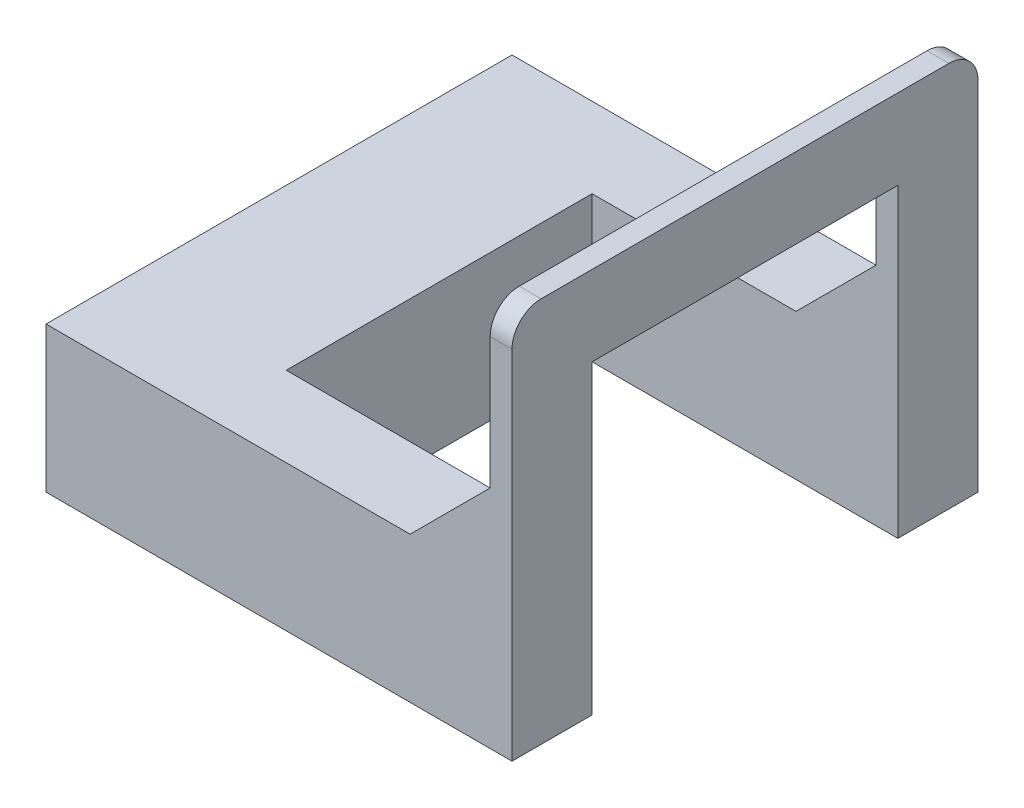
ISO-10303-21;
HEADER;
FILE_DESCRIPTION(('STEP AP214'),'2;1');
FILE_NAME('part.step','',(''),(''),'','','');
FILE_SCHEMA(('AUTOMOTIVE_DESIGN { 1 0 10303 214 1 1 1 1 }'));
ENDSEC;
DATA;
#1=APPLICATION_CONTEXT('core data for automotive mechanical design processes');
#2=APPLICATION_PROTOCOL_DEFINITION('international standard','automotive_design',2000,#1);
#3=PRODUCT_CONTEXT('',#1,'mechanical');
#4=PRODUCT('Part','Part','',(#3));
#5=PRODUCT_RELATED_PRODUCT_CATEGORY('part','',(#4));
#6=PRODUCT_DEFINITION_FORMATION('','',#4);
#7=PRODUCT_DEFINITION_CONTEXT('part definition',#1,'design');
#8=PRODUCT_DEFINITION('design','',#6,#7);
#9=PRODUCT_DEFINITION_SHAPE('','',#8);
#10=(LENGTH_UNIT() NAMED_UNIT(*) SI_UNIT(.MILLI.,.METRE.));
#11=(NAMED_UNIT(*) PLANE_ANGLE_UNIT() SI_UNIT($,.RADIAN.));
#12=(NAMED_UNIT(*) SI_UNIT($,.STERADIAN.) SOLID_ANGLE_UNIT());
#13=UNCERTAINTY_MEASURE_WITH_UNIT(LENGTH_MEASURE(1.E-05),#10,'distance_accuracy_value','');
#14=(GEOMETRIC_REPRESENTATION_CONTEXT(3) GLOBAL_UNCERTAINTY_ASSIGNED_CONTEXT((#13)) GLOBAL_UNIT_ASSIGNED_CONTEXT((#10,
#11,#12)) REPRESENTATION_CONTEXT('',''));
#15=CARTESIAN_POINT('',(0.,0.,0.));
#16=DIRECTION('',(0.,0.,1.));
#17=DIRECTION('',(1.,0.,0.));
#18=AXIS2_PLACEMENT_3D('',#15,#16,#17);
#19=CARTESIAN_POINT('',(0.,100.,0.));
#20=DIRECTION('',(0.,-1.,0.));
#21=DIRECTION('',(0.,0.,-1.));
#22=AXIS2_PLACEMENT_3D('',#19,#20,#21);
#23=PLANE('',#22);
#24=DIRECTION('',(1.,0.,0.));
#25=VECTOR('',#24,1.);
#26=CARTESIAN_POINT('',(320.,100.,-265.));
#27=LINE('',#26,#25);
#28=CARTESIAN_POINT('',(110.,100.,-265.));
#29=VERTEX_POINT('',#28);
#30=CARTESIAN_POINT('',(250.,100.,-265.));
#31=VERTEX_POINT('',#30);
#32=EDGE_CURVE('E208',#29,#31,#27,.T.);
#33=ORIENTED_EDGE('',*,*,#32,.T.);
#34=DIRECTION('',(0.,0.,-1.));
#35=VECTOR('',#34,1.);
#36=CARTESIAN_POINT('',(250.,100.,-265.));
#37=LINE('',#36,#35);
#38=CARTESIAN_POINT('',(250.,100.,-320.));
#39=VERTEX_POINT('',#38);
#40=EDGE_CURVE('E156',#31,#39,#37,.T.);
#41=ORIENTED_EDGE('',*,*,#40,.T.);
#42=DIRECTION('',(-1.,0.,0.));
#43=VECTOR('',#42,1.);
#44=CARTESIAN_POINT('',(0.,100.,-320.));
#45=LINE('',#44,#43);
#46=CARTESIAN_POINT('',(0.,100.,-320.));
#47=VERTEX_POINT('',#46);
#48=EDGE_CURVE('E210',#39,#47,#45,.T.);
#49=ORIENTED_EDGE('',*,*,#48,.T.);
#50=DIRECTION('',(0.,0.,1.));
#51=VECTOR('',#50,1.);
#52=CARTESIAN_POINT('',(0.,100.,0.));
#53=LINE('',#52,#51);
#54=CARTESIAN_POINT('',(0.,100.,0.));
#55=VERTEX_POINT('',#54);
#56=EDGE_CURVE('E197',#47,#55,#53,.T.);
#57=ORIENTED_EDGE('',*,*,#56,.T.);
#58=DIRECTION('',(1.,0.,0.));
#59=VECTOR('',#58,1.);
#60=CARTESIAN_POINT('',(0.,100.,0.));
#61=LINE('',#60,#59);
#62=CARTESIAN_POINT('',(250.,100.,0.));
#63=VERTEX_POINT('',#62);
#64=EDGE_CURVE('E200',#55,#63,#61,.T.);
#65=ORIENTED_EDGE('',*,*,#64,.T.);
#66=DIRECTION('',(0.,0.,1.));
#67=VECTOR('',#66,1.);
#68=CARTESIAN_POINT('',(250.,100.,-55.));
#69=LINE('',#68,#67);
#70=CARTESIAN_POINT('',(250.,100.,-55.));
#71=VERTEX_POINT('',#70);
#72=EDGE_CURVE('E310',#71,#63,#69,.T.);
#73=ORIENTED_EDGE('',*,*,#72,.F.);
#74=DIRECTION('',(-1.,0.,0.));
#75=VECTOR('',#74,1.);
#76=CARTESIAN_POINT('',(110.,100.,-55.));
#77=LINE('',#76,#75);
#78=CARTESIAN_POINT('',(110.,100.,-55.));
#79=VERTEX_POINT('',#78);
#80=EDGE_CURVE('E204',#71,#79,#77,.T.);
#81=ORIENTED_EDGE('',*,*,#80,.T.);
#82=DIRECTION('',(0.,0.,-1.));
#83=VECTOR('',#82,1.);
#84=CARTESIAN_POINT('',(110.,100.,-265.));
#85=LINE('',#84,#83);
#86=EDGE_CURVE('E206',#79,#29,#85,.T.);
#87=ORIENTED_EDGE('',*,*,#86,.T.);
#88=EDGE_LOOP('',(#33,#41,#49,#57,#65,#73,#81,#87));
#89=FACE_BOUND('',#88,.T.);
#90=ADVANCED_FACE('F35',(#89),#23,.F.);
#91=CARTESIAN_POINT('',(0.,100.,0.));
#92=DIRECTION('',(1.,0.,0.));
#93=DIRECTION('',(0.,0.,-1.));
#94=AXIS2_PLACEMENT_3D('',#91,#92,#93);
#95=PLANE('',#94);
#96=DIRECTION('',(0.,0.,1.));
#97=VECTOR('',#96,1.);
#98=CARTESIAN_POINT('',(0.,0.,0.));
#99=LINE('',#98,#97);
#100=CARTESIAN_POINT('',(0.,0.,-320.));
#101=VERTEX_POINT('',#100);
#102=CARTESIAN_POINT('',(0.,0.,0.));
#103=VERTEX_POINT('',#102);
#104=EDGE_CURVE('E194',#101,#103,#99,.T.);
#105=ORIENTED_EDGE('',*,*,#104,.T.);
#106=DIRECTION('',(0.,-1.,0.));
#107=VECTOR('',#106,1.);
#108=CARTESIAN_POINT('',(0.,100.,0.));
#109=LINE('',#108,#107);
#110=EDGE_CURVE('E248',#55,#103,#109,.T.);
#111=ORIENTED_EDGE('',*,*,#110,.F.);
#112=ORIENTED_EDGE('',*,*,#56,.F.);
#113=DIRECTION('',(0.,-1.,0.));
#114=VECTOR('',#113,1.);
#115=CARTESIAN_POINT('',(0.,100.,-320.));
#116=LINE('',#115,#114);
#117=EDGE_CURVE('E212',#47,#101,#116,.T.);
#118=ORIENTED_EDGE('',*,*,#117,.T.);
#119=EDGE_LOOP('',(#105,#111,#112,#118));
#120=FACE_BOUND('',#119,.T.);
#121=ADVANCED_FACE('F300',(#120),#95,.F.);
#122=CARTESIAN_POINT('',(0.,100.,0.));
#123=DIRECTION('',(0.,0.,-1.));
#124=DIRECTION('',(-1.,0.,0.));
#125=AXIS2_PLACEMENT_3D('',#122,#123,#124);
#126=PLANE('',#125);
#127=DIRECTION('',(0.,-1.,0.));
#128=VECTOR('',#127,1.);
#129=CARTESIAN_POINT('',(320.,100.,0.));
#130=LINE('',#129,#128);
#131=CARTESIAN_POINT('',(320.,245.,0.));
#132=VERTEX_POINT('',#131);
#133=CARTESIAN_POINT('',(320.,0.,0.));
#134=VERTEX_POINT('',#133);
#135=EDGE_CURVE('E246',#132,#134,#130,.T.);
#136=ORIENTED_EDGE('',*,*,#135,.F.);
#137=DIRECTION('',(1.,0.,0.));
#138=VECTOR('',#137,1.);
#139=CARTESIAN_POINT('',(305.,245.,0.));
#140=LINE('',#139,#138);
#141=CARTESIAN_POINT('',(305.,245.,0.));
#142=VERTEX_POINT('',#141);
#143=EDGE_CURVE('E58',#132,#142,#140,.F.);
#144=ORIENTED_EDGE('',*,*,#143,.T.);
#145=DIRECTION('',(0.,-1.,0.));
#146=VECTOR('',#145,1.);
#147=CARTESIAN_POINT('',(305.,0.,0.));
#148=LINE('',#147,#146);
#149=CARTESIAN_POINT('',(305.,155.,0.));
#150=VERTEX_POINT('',#149);
#151=EDGE_CURVE('E183',#142,#150,#148,.T.);
#152=ORIENTED_EDGE('',*,*,#151,.T.);
#153=DIRECTION('',(-0.707106781186548,-0.707106781186548,0.));
#154=VECTOR('',#153,1.);
#155=CARTESIAN_POINT('',(305.,155.,0.));
#156=LINE('',#155,#154);
#157=EDGE_CURVE('E306',#150,#63,#156,.T.);
#158=ORIENTED_EDGE('',*,*,#157,.T.);
#159=ORIENTED_EDGE('',*,*,#64,.F.);
#160=ORIENTED_EDGE('',*,*,#110,.T.);
#161=DIRECTION('',(1.,0.,0.));
#162=VECTOR('',#161,1.);
#163=CARTESIAN_POINT('',(0.,0.,0.));
#164=LINE('',#163,#162);
#165=EDGE_CURVE('E215',#103,#134,#164,.T.);
#166=ORIENTED_EDGE('',*,*,#165,.T.);
#167=EDGE_LOOP('',(#136,#144,#152,#158,#159,#160,#166));
#168=FACE_BOUND('',#167,.T.);
#169=ADVANCED_FACE('F272',(#168),#126,.F.);
#170=CARTESIAN_POINT('',(110.,100.,-55.));
#171=DIRECTION('',(0.,0.,1.));
#172=DIRECTION('',(1.,0.,0.));
#173=AXIS2_PLACEMENT_3D('',#170,#171,#172);
#174=PLANE('',#173);
#175=ORIENTED_EDGE('',*,*,#80,.F.);
#176=DIRECTION('',(-0.707106781186548,-0.707106781186548,0.));
#177=VECTOR('',#176,1.);
#178=CARTESIAN_POINT('',(305.,155.,-55.));
#179=LINE('',#178,#177);
#180=CARTESIAN_POINT('',(305.,155.,-55.));
#181=VERTEX_POINT('',#180);
#182=EDGE_CURVE('E308',#181,#71,#179,.T.);
#183=ORIENTED_EDGE('',*,*,#182,.F.);
#184=DIRECTION('',(0.,1.,0.));
#185=VECTOR('',#184,1.);
#186=CARTESIAN_POINT('',(305.,0.,-55.));
#187=LINE('',#186,#185);
#188=CARTESIAN_POINT('',(305.,210.,-55.));
#189=VERTEX_POINT('',#188);
#190=EDGE_CURVE('E177',#181,#189,#187,.T.);
#191=ORIENTED_EDGE('',*,*,#190,.T.);
#192=DIRECTION('',(1.,0.,0.));
#193=VECTOR('',#192,1.);
#194=CARTESIAN_POINT('',(305.,210.,-55.));
#195=LINE('',#194,#193);
#196=CARTESIAN_POINT('',(320.,210.,-55.));
#197=VERTEX_POINT('',#196);
#198=EDGE_CURVE('E185',#189,#197,#195,.T.);
#199=ORIENTED_EDGE('',*,*,#198,.T.);
#200=DIRECTION('',(0.,-1.,0.));
#201=VECTOR('',#200,1.);
#202=CARTESIAN_POINT('',(320.,100.,-55.));
#203=LINE('',#202,#201);
#204=CARTESIAN_POINT('',(320.,0.,-55.));
#205=VERTEX_POINT('',#204);
#206=EDGE_CURVE('E243',#197,#205,#203,.T.);
#207=ORIENTED_EDGE('',*,*,#206,.T.);
#208=DIRECTION('',(-1.,0.,0.));
#209=VECTOR('',#208,1.);
#210=CARTESIAN_POINT('',(110.,0.,-55.));
#211=LINE('',#210,#209);
#212=CARTESIAN_POINT('',(110.,0.,-55.));
#213=VERTEX_POINT('',#212);
#214=EDGE_CURVE('E220',#205,#213,#211,.T.);
#215=ORIENTED_EDGE('',*,*,#214,.T.);
#216=DIRECTION('',(0.,-1.,0.));
#217=VECTOR('',#216,1.);
#218=CARTESIAN_POINT('',(110.,100.,-55.));
#219=LINE('',#218,#217);
#220=EDGE_CURVE('E240',#79,#213,#219,.T.);
#221=ORIENTED_EDGE('',*,*,#220,.F.);
#222=EDGE_LOOP('',(#175,#183,#191,#199,#207,#215,#221));
#223=FACE_BOUND('',#222,.T.);
#224=ADVANCED_FACE('F282',(#223),#174,.F.);
#225=CARTESIAN_POINT('',(110.,100.,-265.));
#226=DIRECTION('',(-1.,0.,0.));
#227=DIRECTION('',(0.,0.,1.));
#228=AXIS2_PLACEMENT_3D('',#225,#226,#227);
#229=PLANE('',#228);
#230=DIRECTION('',(0.,0.,-1.));
#231=VECTOR('',#230,1.);
#232=CARTESIAN_POINT('',(110.,0.,-265.));
#233=LINE('',#232,#231);
#234=CARTESIAN_POINT('',(110.,0.,-265.));
#235=VERTEX_POINT('',#234);
#236=EDGE_CURVE('E222',#213,#235,#233,.T.);
#237=ORIENTED_EDGE('',*,*,#236,.T.);
#238=DIRECTION('',(0.,-1.,0.));
#239=VECTOR('',#238,1.);
#240=CARTESIAN_POINT('',(110.,100.,-265.));
#241=LINE('',#240,#239);
#242=EDGE_CURVE('E237',#29,#235,#241,.T.);
#243=ORIENTED_EDGE('',*,*,#242,.F.);
#244=ORIENTED_EDGE('',*,*,#86,.F.);
#245=ORIENTED_EDGE('',*,*,#220,.T.);
#246=EDGE_LOOP('',(#237,#243,#244,#245));
#247=FACE_BOUND('',#246,.T.);
#248=ADVANCED_FACE('F320',(#247),#229,.F.);
#249=CARTESIAN_POINT('',(320.,100.,-265.));
#250=DIRECTION('',(0.,0.,-1.));
#251=DIRECTION('',(-1.,0.,0.));
#252=AXIS2_PLACEMENT_3D('',#249,#250,#251);
#253=PLANE('',#252);
#254=DIRECTION('',(0.707106781186548,0.707106781186548,0.));
#255=VECTOR('',#254,1.);
#256=CARTESIAN_POINT('',(250.,100.,-265.));
#257=LINE('',#256,#255);
#258=CARTESIAN_POINT('',(305.,155.,-265.));
#259=VERTEX_POINT('',#258);
#260=EDGE_CURVE('E151',#31,#259,#257,.T.);
#261=ORIENTED_EDGE('',*,*,#260,.F.);
#262=ORIENTED_EDGE('',*,*,#32,.F.);
#263=ORIENTED_EDGE('',*,*,#242,.T.);
#264=DIRECTION('',(1.,0.,0.));
#265=VECTOR('',#264,1.);
#266=CARTESIAN_POINT('',(320.,0.,-265.));
#267=LINE('',#266,#265);
#268=CARTESIAN_POINT('',(320.,0.,-265.));
#269=VERTEX_POINT('',#268);
#270=EDGE_CURVE('E224',#235,#269,#267,.T.);
#271=ORIENTED_EDGE('',*,*,#270,.T.);
#272=DIRECTION('',(0.,-1.,0.));
#273=VECTOR('',#272,1.);
#274=CARTESIAN_POINT('',(320.,100.,-265.));
#275=LINE('',#274,#273);
#276=CARTESIAN_POINT('',(320.,210.,-265.));
#277=VERTEX_POINT('',#276);
#278=EDGE_CURVE('E234',#277,#269,#275,.T.);
#279=ORIENTED_EDGE('',*,*,#278,.F.);
#280=DIRECTION('',(1.,0.,0.));
#281=VECTOR('',#280,1.);
#282=CARTESIAN_POINT('',(305.,210.,-265.));
#283=LINE('',#282,#281);
#284=CARTESIAN_POINT('',(305.,210.,-265.));
#285=VERTEX_POINT('',#284);
#286=EDGE_CURVE('E172',#285,#277,#283,.T.);
#287=ORIENTED_EDGE('',*,*,#286,.F.);
#288=DIRECTION('',(0.,-1.,0.));
#289=VECTOR('',#288,1.);
#290=CARTESIAN_POINT('',(305.,210.,-265.));
#291=LINE('',#290,#289);
#292=EDGE_CURVE('E166',#285,#259,#291,.T.);
#293=ORIENTED_EDGE('',*,*,#292,.T.);
#294=EDGE_LOOP('',(#261,#262,#263,#271,#279,#287,#293));
#295=FACE_BOUND('',#294,.T.);
#296=ADVANCED_FACE('F170',(#295),#253,.F.);
#297=CARTESIAN_POINT('',(320.,100.,-320.));
#298=DIRECTION('',(-1.,0.,0.));
#299=DIRECTION('',(0.,0.,1.));
#300=AXIS2_PLACEMENT_3D('',#297,#298,#299);
#301=PLANE('',#300);
#302=DIRECTION('',(0.,0.,1.));
#303=VECTOR('',#302,1.);
#304=CARTESIAN_POINT('',(320.,265.,0.));
#305=LINE('',#304,#303);
#306=CARTESIAN_POINT('',(320.,265.,-300.));
#307=VERTEX_POINT('',#306);
#308=CARTESIAN_POINT('',(320.,265.,-20.));
#309=VERTEX_POINT('',#308);
#310=EDGE_CURVE('E189',#307,#309,#305,.T.);
#311=ORIENTED_EDGE('',*,*,#310,.T.);
#312=CARTESIAN_POINT('',(320.,245.,-20.));
#313=DIRECTION('',(-1.,0.,0.));
#314=DIRECTION('',(0.,0.,1.));
#315=AXIS2_PLACEMENT_3D('',#312,#313,#314);
#316=CIRCLE('',#315,20.);
#317=EDGE_CURVE('E258',#309,#132,#316,.F.);
#318=ORIENTED_EDGE('',*,*,#317,.T.);
#319=ORIENTED_EDGE('',*,*,#135,.T.);
#320=DIRECTION('',(0.,0.,-1.));
#321=VECTOR('',#320,1.);
#322=CARTESIAN_POINT('',(320.,0.,-55.));
#323=LINE('',#322,#321);
#324=EDGE_CURVE('E218',#134,#205,#323,.T.);
#325=ORIENTED_EDGE('',*,*,#324,.T.);
#326=ORIENTED_EDGE('',*,*,#206,.F.);
#327=DIRECTION('',(0.,0.,-1.));
#328=VECTOR('',#327,1.);
#329=CARTESIAN_POINT('',(320.,210.,-55.));
#330=LINE('',#329,#328);
#331=EDGE_CURVE('E186',#197,#277,#330,.T.);
#332=ORIENTED_EDGE('',*,*,#331,.T.);
#333=ORIENTED_EDGE('',*,*,#278,.T.);
#334=DIRECTION('',(0.,0.,-1.));
#335=VECTOR('',#334,1.);
#336=CARTESIAN_POINT('',(320.,0.,-320.));
#337=LINE('',#336,#335);
#338=CARTESIAN_POINT('',(320.,0.,-320.));
#339=VERTEX_POINT('',#338);
#340=EDGE_CURVE('E226',#269,#339,#337,.T.);
#341=ORIENTED_EDGE('',*,*,#340,.T.);
#342=DIRECTION('',(0.,-1.,0.));
#343=VECTOR('',#342,1.);
#344=CARTESIAN_POINT('',(320.,100.,-320.));
#345=LINE('',#344,#343);
#346=CARTESIAN_POINT('',(320.,245.,-320.));
#347=VERTEX_POINT('',#346);
#348=EDGE_CURVE('E232',#347,#339,#345,.T.);
#349=ORIENTED_EDGE('',*,*,#348,.F.);
#350=CARTESIAN_POINT('',(320.,245.,-300.));
#351=DIRECTION('',(-1.,0.,0.));
#352=DIRECTION('',(0.,0.,1.));
#353=AXIS2_PLACEMENT_3D('',#350,#351,#352);
#354=CIRCLE('',#353,20.);
#355=EDGE_CURVE('E256',#347,#307,#354,.F.);
#356=ORIENTED_EDGE('',*,*,#355,.T.);
#357=EDGE_LOOP('',(#311,#318,#319,#325,#326,#332,#333,#341,#349,#356));
#358=FACE_BOUND('',#357,.T.);
#359=ADVANCED_FACE('F271',(#358),#301,.F.);
#360=CARTESIAN_POINT('',(0.,100.,-320.));
#361=DIRECTION('',(0.,0.,1.));
#362=DIRECTION('',(1.,0.,0.));
#363=AXIS2_PLACEMENT_3D('',#360,#361,#362);
#364=PLANE('',#363);
#365=DIRECTION('',(0.,1.,0.));
#366=VECTOR('',#365,1.);
#367=CARTESIAN_POINT('',(305.,265.,-320.));
#368=LINE('',#367,#366);
#369=CARTESIAN_POINT('',(305.,155.,-320.));
#370=VERTEX_POINT('',#369);
#371=CARTESIAN_POINT('',(305.,245.,-320.));
#372=VERTEX_POINT('',#371);
#373=EDGE_CURVE('E168',#370,#372,#368,.T.);
#374=ORIENTED_EDGE('',*,*,#373,.T.);
#375=DIRECTION('',(1.,0.,0.));
#376=VECTOR('',#375,1.);
#377=CARTESIAN_POINT('',(320.,245.,-320.));
#378=LINE('',#377,#376);
#379=EDGE_CURVE('E11',#372,#347,#378,.T.);
#380=ORIENTED_EDGE('',*,*,#379,.T.);
#381=ORIENTED_EDGE('',*,*,#348,.T.);
#382=DIRECTION('',(-1.,0.,0.));
#383=VECTOR('',#382,1.);
#384=CARTESIAN_POINT('',(0.,0.,-320.));
#385=LINE('',#384,#383);
#386=EDGE_CURVE('E201',#339,#101,#385,.T.);
#387=ORIENTED_EDGE('',*,*,#386,.T.);
#388=ORIENTED_EDGE('',*,*,#117,.F.);
#389=ORIENTED_EDGE('',*,*,#48,.F.);
#390=DIRECTION('',(0.707106781186548,0.707106781186548,0.));
#391=VECTOR('',#390,1.);
#392=CARTESIAN_POINT('',(250.,100.,-320.));
#393=LINE('',#392,#391);
#394=EDGE_CURVE('E161',#39,#370,#393,.T.);
#395=ORIENTED_EDGE('',*,*,#394,.T.);
#396=EDGE_LOOP('',(#374,#380,#381,#387,#388,#389,#395));
#397=FACE_BOUND('',#396,.T.);
#398=ADVANCED_FACE('F296',(#397),#364,.F.);
#399=CARTESIAN_POINT('',(0.,0.,0.));
#400=DIRECTION('',(0.,-1.,0.));
#401=DIRECTION('',(0.,0.,-1.));
#402=AXIS2_PLACEMENT_3D('',#399,#400,#401);
#403=PLANE('',#402);
#404=ORIENTED_EDGE('',*,*,#324,.F.);
#405=ORIENTED_EDGE('',*,*,#165,.F.);
#406=ORIENTED_EDGE('',*,*,#104,.F.);
#407=ORIENTED_EDGE('',*,*,#386,.F.);
#408=ORIENTED_EDGE('',*,*,#340,.F.);
#409=ORIENTED_EDGE('',*,*,#270,.F.);
#410=ORIENTED_EDGE('',*,*,#236,.F.);
#411=ORIENTED_EDGE('',*,*,#214,.F.);
#412=EDGE_LOOP('',(#404,#405,#406,#407,#408,#409,#410,#411));
#413=FACE_BOUND('',#412,.T.);
#414=ADVANCED_FACE('F278',(#413),#403,.T.);
#415=CARTESIAN_POINT('',(305.,0.,0.));
#416=DIRECTION('',(1.,0.,0.));
#417=DIRECTION('',(0.,0.,-1.));
#418=AXIS2_PLACEMENT_3D('',#415,#416,#417);
#419=PLANE('',#418);
#420=ORIENTED_EDGE('',*,*,#151,.F.);
#421=CARTESIAN_POINT('',(305.,245.,-20.));
#422=DIRECTION('',(1.,0.,0.));
#423=DIRECTION('',(0.,0.,-1.));
#424=AXIS2_PLACEMENT_3D('',#421,#422,#423);
#425=CIRCLE('',#424,20.);
#426=CARTESIAN_POINT('',(305.,265.,-20.));
#427=VERTEX_POINT('',#426);
#428=EDGE_CURVE('E43',#142,#427,#425,.F.);
#429=ORIENTED_EDGE('',*,*,#428,.T.);
#430=DIRECTION('',(0.,0.,1.));
#431=VECTOR('',#430,1.);
#432=CARTESIAN_POINT('',(305.,265.,0.));
#433=LINE('',#432,#431);
#434=CARTESIAN_POINT('',(305.,265.,-300.));
#435=VERTEX_POINT('',#434);
#436=EDGE_CURVE('E175',#435,#427,#433,.T.);
#437=ORIENTED_EDGE('',*,*,#436,.F.);
#438=CARTESIAN_POINT('',(305.,245.,-300.));
#439=DIRECTION('',(1.,0.,0.));
#440=DIRECTION('',(0.,0.,-1.));
#441=AXIS2_PLACEMENT_3D('',#438,#439,#440);
#442=CIRCLE('',#441,20.);
#443=EDGE_CURVE('E50',#435,#372,#442,.F.);
#444=ORIENTED_EDGE('',*,*,#443,.T.);
#445=ORIENTED_EDGE('',*,*,#373,.F.);
#446=DIRECTION('',(0.,0.,-1.));
#447=VECTOR('',#446,1.);
#448=CARTESIAN_POINT('',(305.,155.,-265.));
#449=LINE('',#448,#447);
#450=EDGE_CURVE('E154',#259,#370,#449,.T.);
#451=ORIENTED_EDGE('',*,*,#450,.F.);
#452=ORIENTED_EDGE('',*,*,#292,.F.);
#453=DIRECTION('',(0.,0.,-1.));
#454=VECTOR('',#453,1.);
#455=CARTESIAN_POINT('',(305.,210.,-55.));
#456=LINE('',#455,#454);
#457=EDGE_CURVE('E173',#189,#285,#456,.T.);
#458=ORIENTED_EDGE('',*,*,#457,.F.);
#459=ORIENTED_EDGE('',*,*,#190,.F.);
#460=DIRECTION('',(0.,0.,1.));
#461=VECTOR('',#460,1.);
#462=CARTESIAN_POINT('',(305.,155.,-55.));
#463=LINE('',#462,#461);
#464=EDGE_CURVE('E190',#181,#150,#463,.T.);
#465=ORIENTED_EDGE('',*,*,#464,.T.);
#466=EDGE_LOOP('',(#420,#429,#437,#444,#445,#451,#452,#458,#459,#465));
#467=FACE_BOUND('',#466,.T.);
#468=ADVANCED_FACE('F164',(#467),#419,.F.);
#469=CARTESIAN_POINT('',(305.,265.,0.));
#470=DIRECTION('',(0.,1.,0.));
#471=DIRECTION('',(0.,0.,1.));
#472=AXIS2_PLACEMENT_3D('',#469,#470,#471);
#473=PLANE('',#472);
#474=ORIENTED_EDGE('',*,*,#436,.T.);
#475=DIRECTION('',(1.,0.,0.));
#476=VECTOR('',#475,1.);
#477=CARTESIAN_POINT('',(320.,265.,-20.));
#478=LINE('',#477,#476);
#479=EDGE_CURVE('E253',#427,#309,#478,.T.);
#480=ORIENTED_EDGE('',*,*,#479,.T.);
#481=ORIENTED_EDGE('',*,*,#310,.F.);
#482=DIRECTION('',(1.,0.,0.));
#483=VECTOR('',#482,1.);
#484=CARTESIAN_POINT('',(305.,265.,-300.));
#485=LINE('',#484,#483);
#486=EDGE_CURVE('E251',#307,#435,#485,.F.);
#487=ORIENTED_EDGE('',*,*,#486,.T.);
#488=EDGE_LOOP('',(#474,#480,#481,#487));
#489=FACE_BOUND('',#488,.T.);
#490=ADVANCED_FACE('F266',(#489),#473,.T.);
#491=CARTESIAN_POINT('',(305.,210.,-55.));
#492=DIRECTION('',(0.,-1.,0.));
#493=DIRECTION('',(0.,0.,-1.));
#494=AXIS2_PLACEMENT_3D('',#491,#492,#493);
#495=PLANE('',#494);
#496=ORIENTED_EDGE('',*,*,#331,.F.);
#497=ORIENTED_EDGE('',*,*,#198,.F.);
#498=ORIENTED_EDGE('',*,*,#457,.T.);
#499=ORIENTED_EDGE('',*,*,#286,.T.);
#500=EDGE_LOOP('',(#496,#497,#498,#499));
#501=FACE_BOUND('',#500,.T.);
#502=ADVANCED_FACE('F289',(#501),#495,.T.);
#503=CARTESIAN_POINT('',(305.,155.,-55.));
#504=DIRECTION('',(-0.707106781186548,0.707106781186548,0.));
#505=DIRECTION('',(-0.707106781186548,-0.707106781186548,0.));
#506=AXIS2_PLACEMENT_3D('',#503,#504,#505);
#507=PLANE('',#506);
#508=ORIENTED_EDGE('',*,*,#157,.F.);
#509=ORIENTED_EDGE('',*,*,#464,.F.);
#510=ORIENTED_EDGE('',*,*,#182,.T.);
#511=ORIENTED_EDGE('',*,*,#72,.T.);
#512=EDGE_LOOP('',(#508,#509,#510,#511));
#513=FACE_BOUND('',#512,.T.);
#514=ADVANCED_FACE('F316',(#513),#507,.T.);
#515=CARTESIAN_POINT('',(250.,100.,-265.));
#516=DIRECTION('',(-0.707106781186548,0.707106781186548,0.));
#517=DIRECTION('',(-0.707106781186548,-0.707106781186548,0.));
#518=AXIS2_PLACEMENT_3D('',#515,#516,#517);
#519=PLANE('',#518);
#520=ORIENTED_EDGE('',*,*,#394,.F.);
#521=ORIENTED_EDGE('',*,*,#40,.F.);
#522=ORIENTED_EDGE('',*,*,#260,.T.);
#523=ORIENTED_EDGE('',*,*,#450,.T.);
#524=EDGE_LOOP('',(#520,#521,#522,#523));
#525=FACE_BOUND('',#524,.T.);
#526=ADVANCED_FACE('F153',(#525),#519,.T.);
#527=CARTESIAN_POINT('',(305.,245.,-20.));
#528=DIRECTION('',(-1.,0.,0.));
#529=DIRECTION('',(0.,0.,1.));
#530=AXIS2_PLACEMENT_3D('',#527,#528,#529);
#531=CYLINDRICAL_SURFACE('',#530,20.);
#532=ORIENTED_EDGE('',*,*,#428,.F.);
#533=ORIENTED_EDGE('',*,*,#143,.F.);
#534=ORIENTED_EDGE('',*,*,#317,.F.);
#535=ORIENTED_EDGE('',*,*,#479,.F.);
#536=EDGE_LOOP('',(#532,#533,#534,#535));
#537=FACE_BOUND('',#536,.T.);
#538=ADVANCED_FACE('F269',(#537),#531,.T.);
#539=CARTESIAN_POINT('',(0.,245.,-300.));
#540=DIRECTION('',(-1.,0.,0.));
#541=DIRECTION('',(0.,0.,1.));
#542=AXIS2_PLACEMENT_3D('',#539,#540,#541);
#543=CYLINDRICAL_SURFACE('',#542,20.);
#544=ORIENTED_EDGE('',*,*,#443,.F.);
#545=ORIENTED_EDGE('',*,*,#486,.F.);
#546=ORIENTED_EDGE('',*,*,#355,.F.);
#547=ORIENTED_EDGE('',*,*,#379,.F.);
#548=EDGE_LOOP('',(#544,#545,#546,#547));
#549=FACE_BOUND('',#548,.T.);
#550=ADVANCED_FACE('F37',(#549),#543,.T.);
#551=CLOSED_SHELL('',(#90,#121,#169,#224,#248,#296,#359,#398,#414,#468,#490,#502,#514,#526,#538,#550));
#552=MANIFOLD_SOLID_BREP('B2',#551);
#553=ADVANCED_BREP_SHAPE_REPRESENTATION('',(#18,#552),#14);
#554=SHAPE_DEFINITION_REPRESENTATION(#9,#553);
ENDSEC;
END-ISO-10303-21;
